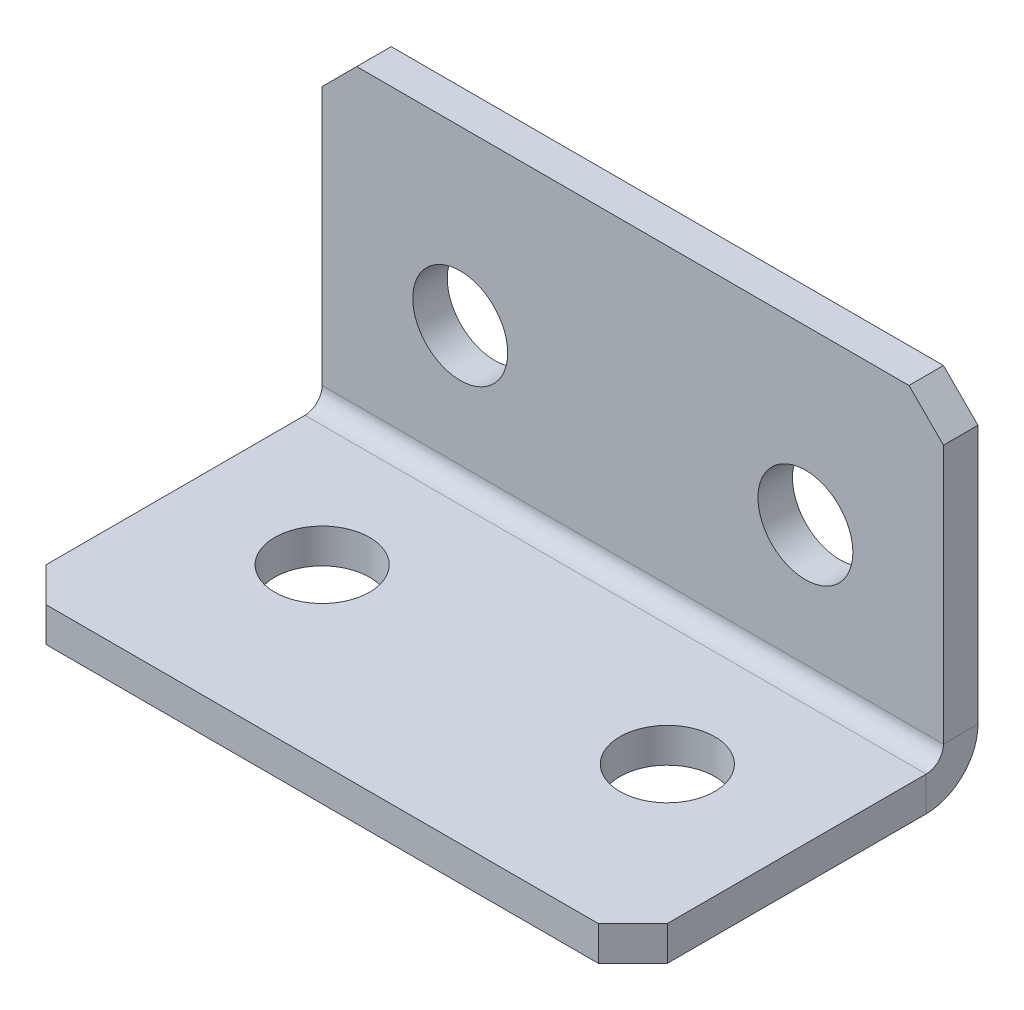
ISO-10303-21;
HEADER;
FILE_DESCRIPTION(('STEP AP214'),'2;1');
FILE_NAME('part.step','',(''),(''),'','','');
FILE_SCHEMA(('AUTOMOTIVE_DESIGN { 1 0 10303 214 1 1 1 1 }'));
ENDSEC;
DATA;
#1=APPLICATION_CONTEXT('core data for automotive mechanical design processes');
#2=APPLICATION_PROTOCOL_DEFINITION('international standard','automotive_design',2000,#1);
#3=PRODUCT_CONTEXT('',#1,'mechanical');
#4=PRODUCT('Part','Part','',(#3));
#5=PRODUCT_RELATED_PRODUCT_CATEGORY('part','',(#4));
#6=PRODUCT_DEFINITION_FORMATION('','',#4);
#7=PRODUCT_DEFINITION_CONTEXT('part definition',#1,'design');
#8=PRODUCT_DEFINITION('design','',#6,#7);
#9=PRODUCT_DEFINITION_SHAPE('','',#8);
#10=(LENGTH_UNIT() NAMED_UNIT(*) SI_UNIT(.MILLI.,.METRE.));
#11=(NAMED_UNIT(*) PLANE_ANGLE_UNIT() SI_UNIT($,.RADIAN.));
#12=(NAMED_UNIT(*) SI_UNIT($,.STERADIAN.) SOLID_ANGLE_UNIT());
#13=UNCERTAINTY_MEASURE_WITH_UNIT(LENGTH_MEASURE(1.E-05),#10,'distance_accuracy_value','');
#14=(GEOMETRIC_REPRESENTATION_CONTEXT(3) GLOBAL_UNCERTAINTY_ASSIGNED_CONTEXT((#13)) GLOBAL_UNIT_ASSIGNED_CONTEXT((#10,
#11,#12)) REPRESENTATION_CONTEXT('',''));
#15=CARTESIAN_POINT('',(0.,0.,0.));
#16=DIRECTION('',(0.,0.,1.));
#17=DIRECTION('',(1.,0.,0.));
#18=AXIS2_PLACEMENT_3D('',#15,#16,#17);
#19=CARTESIAN_POINT('',(18.,0.,2.));
#20=DIRECTION('',(-1.,0.,0.));
#21=DIRECTION('',(0.,1.,0.));
#22=AXIS2_PLACEMENT_3D('',#19,#20,#21);
#23=PLANE('',#22);
#24=DIRECTION('',(0.,1.,0.));
#25=VECTOR('',#24,1.);
#26=CARTESIAN_POINT('',(18.,0.,0.));
#27=LINE('',#26,#25);
#28=CARTESIAN_POINT('',(18.,3.,0.));
#29=VERTEX_POINT('',#28);
#30=CARTESIAN_POINT('',(18.,18.,0.));
#31=VERTEX_POINT('',#30);
#32=EDGE_CURVE('E266',#29,#31,#27,.T.);
#33=ORIENTED_EDGE('',*,*,#32,.T.);
#34=DIRECTION('',(0.,0.,-1.));
#35=VECTOR('',#34,1.);
#36=CARTESIAN_POINT('',(18.,18.,2.));
#37=LINE('',#36,#35);
#38=CARTESIAN_POINT('',(18.,18.,2.));
#39=VERTEX_POINT('',#38);
#40=EDGE_CURVE('E296',#31,#39,#37,.F.);
#41=ORIENTED_EDGE('',*,*,#40,.T.);
#42=DIRECTION('',(0.,1.,0.));
#43=VECTOR('',#42,1.);
#44=CARTESIAN_POINT('',(18.,0.,2.));
#45=LINE('',#44,#43);
#46=CARTESIAN_POINT('',(18.,3.,2.));
#47=VERTEX_POINT('',#46);
#48=EDGE_CURVE('E254',#47,#39,#45,.T.);
#49=ORIENTED_EDGE('',*,*,#48,.F.);
#50=DIRECTION('',(0.,0.,-1.));
#51=VECTOR('',#50,1.);
#52=CARTESIAN_POINT('',(18.,3.,2.));
#53=LINE('',#52,#51);
#54=EDGE_CURVE('E233',#47,#29,#53,.T.);
#55=ORIENTED_EDGE('',*,*,#54,.T.);
#56=EDGE_LOOP('',(#33,#41,#49,#55));
#57=FACE_BOUND('',#56,.T.);
#58=ADVANCED_FACE('F70',(#57),#23,.F.);
#59=CARTESIAN_POINT('',(0.,0.,2.));
#60=DIRECTION('',(0.,0.,-1.));
#61=DIRECTION('',(-1.,0.,0.));
#62=AXIS2_PLACEMENT_3D('',#59,#60,#61);
#63=PLANE('',#62);
#64=CARTESIAN_POINT('',(-10.,10.,2.));
#65=DIRECTION('',(0.,0.,1.));
#66=DIRECTION('',(1.,0.,0.));
#67=AXIS2_PLACEMENT_3D('',#64,#65,#66);
#68=CIRCLE('',#67,2.75);
#69=CARTESIAN_POINT('',(-7.25,10.,2.));
#70=VERTEX_POINT('',#69);
#71=EDGE_CURVE('E675',#70,#70,#68,.T.);
#72=ORIENTED_EDGE('',*,*,#71,.F.);
#73=EDGE_LOOP('',(#72));
#74=FACE_BOUND('',#73,.T.);
#75=CARTESIAN_POINT('',(10.,10.,2.));
#76=DIRECTION('',(0.,0.,1.));
#77=DIRECTION('',(1.,0.,0.));
#78=AXIS2_PLACEMENT_3D('',#75,#76,#77);
#79=CIRCLE('',#78,2.75);
#80=CARTESIAN_POINT('',(12.75,10.,2.));
#81=VERTEX_POINT('',#80);
#82=EDGE_CURVE('E666',#81,#81,#79,.T.);
#83=ORIENTED_EDGE('',*,*,#82,.F.);
#84=EDGE_LOOP('',(#83));
#85=FACE_BOUND('',#84,.T.);
#86=ORIENTED_EDGE('',*,*,#48,.T.);
#87=DIRECTION('',(0.707106781186549,-0.707106781186546,0.));
#88=VECTOR('',#87,1.);
#89=CARTESIAN_POINT('',(18.,18.,2.));
#90=LINE('',#89,#88);
#91=CARTESIAN_POINT('',(16.,20.,2.));
#92=VERTEX_POINT('',#91);
#93=EDGE_CURVE('E303',#39,#92,#90,.F.);
#94=ORIENTED_EDGE('',*,*,#93,.T.);
#95=DIRECTION('',(-1.,0.,0.));
#96=VECTOR('',#95,1.);
#97=CARTESIAN_POINT('',(-18.,20.,2.));
#98=LINE('',#97,#96);
#99=CARTESIAN_POINT('',(-16.,20.,2.));
#100=VERTEX_POINT('',#99);
#101=EDGE_CURVE('E259',#92,#100,#98,.T.);
#102=ORIENTED_EDGE('',*,*,#101,.T.);
#103=DIRECTION('',(0.707106781186546,0.707106781186549,0.));
#104=VECTOR('',#103,1.);
#105=CARTESIAN_POINT('',(-16.,20.,2.));
#106=LINE('',#105,#104);
#107=CARTESIAN_POINT('',(-18.,18.,2.));
#108=VERTEX_POINT('',#107);
#109=EDGE_CURVE('E300',#100,#108,#106,.F.);
#110=ORIENTED_EDGE('',*,*,#109,.T.);
#111=DIRECTION('',(0.,-1.,0.));
#112=VECTOR('',#111,1.);
#113=CARTESIAN_POINT('',(-18.,0.,2.));
#114=LINE('',#113,#112);
#115=CARTESIAN_POINT('',(-18.,3.,2.));
#116=VERTEX_POINT('',#115);
#117=EDGE_CURVE('E251',#108,#116,#114,.T.);
#118=ORIENTED_EDGE('',*,*,#117,.T.);
#119=DIRECTION('',(1.,0.,0.));
#120=VECTOR('',#119,1.);
#121=CARTESIAN_POINT('',(18.,3.,2.));
#122=LINE('',#121,#120);
#123=EDGE_CURVE('E238',#47,#116,#122,.F.);
#124=ORIENTED_EDGE('',*,*,#123,.F.);
#125=EDGE_LOOP('',(#86,#94,#102,#110,#118,#124));
#126=FACE_BOUND('',#125,.T.);
#127=ADVANCED_FACE('F328',(#74,#85,#126),#63,.F.);
#128=CARTESIAN_POINT('',(0.,0.,0.));
#129=DIRECTION('',(0.,0.,-1.));
#130=DIRECTION('',(-1.,0.,0.));
#131=AXIS2_PLACEMENT_3D('',#128,#129,#130);
#132=PLANE('',#131);
#133=CARTESIAN_POINT('',(-10.,10.,0.));
#134=DIRECTION('',(0.,0.,-1.));
#135=DIRECTION('',(-1.,0.,0.));
#136=AXIS2_PLACEMENT_3D('',#133,#134,#135);
#137=CIRCLE('',#136,2.75);
#138=CARTESIAN_POINT('',(-12.75,10.,0.));
#139=VERTEX_POINT('',#138);
#140=EDGE_CURVE('E661',#139,#139,#137,.T.);
#141=ORIENTED_EDGE('',*,*,#140,.F.);
#142=EDGE_LOOP('',(#141));
#143=FACE_BOUND('',#142,.T.);
#144=CARTESIAN_POINT('',(10.,10.,0.));
#145=DIRECTION('',(0.,0.,-1.));
#146=DIRECTION('',(-1.,0.,0.));
#147=AXIS2_PLACEMENT_3D('',#144,#145,#146);
#148=CIRCLE('',#147,2.75);
#149=CARTESIAN_POINT('',(7.25,10.,0.));
#150=VERTEX_POINT('',#149);
#151=EDGE_CURVE('E228',#150,#150,#148,.T.);
#152=ORIENTED_EDGE('',*,*,#151,.F.);
#153=EDGE_LOOP('',(#152));
#154=FACE_BOUND('',#153,.T.);
#155=DIRECTION('',(-1.,0.,0.));
#156=VECTOR('',#155,1.);
#157=CARTESIAN_POINT('',(0.,20.,0.));
#158=LINE('',#157,#156);
#159=CARTESIAN_POINT('',(16.,20.,0.));
#160=VERTEX_POINT('',#159);
#161=CARTESIAN_POINT('',(-16.,20.,0.));
#162=VERTEX_POINT('',#161);
#163=EDGE_CURVE('E255',#160,#162,#158,.T.);
#164=ORIENTED_EDGE('',*,*,#163,.F.);
#165=DIRECTION('',(-0.707106781186549,0.707106781186546,0.));
#166=VECTOR('',#165,1.);
#167=CARTESIAN_POINT('',(18.,18.,0.));
#168=LINE('',#167,#166);
#169=EDGE_CURVE('E80',#160,#31,#168,.F.);
#170=ORIENTED_EDGE('',*,*,#169,.T.);
#171=ORIENTED_EDGE('',*,*,#32,.F.);
#172=DIRECTION('',(1.,0.,0.));
#173=VECTOR('',#172,1.);
#174=CARTESIAN_POINT('',(18.,3.,0.));
#175=LINE('',#174,#173);
#176=CARTESIAN_POINT('',(-18.,3.00000000000001,0.));
#177=VERTEX_POINT('',#176);
#178=EDGE_CURVE('E169',#29,#177,#175,.F.);
#179=ORIENTED_EDGE('',*,*,#178,.T.);
#180=DIRECTION('',(0.,1.,0.));
#181=VECTOR('',#180,1.);
#182=CARTESIAN_POINT('',(-18.,0.,0.));
#183=LINE('',#182,#181);
#184=CARTESIAN_POINT('',(-18.,18.,0.));
#185=VERTEX_POINT('',#184);
#186=EDGE_CURVE('E248',#185,#177,#183,.F.);
#187=ORIENTED_EDGE('',*,*,#186,.F.);
#188=DIRECTION('',(-0.707106781186546,-0.707106781186549,0.));
#189=VECTOR('',#188,1.);
#190=CARTESIAN_POINT('',(-18.,18.,0.));
#191=LINE('',#190,#189);
#192=EDGE_CURVE('E92',#185,#162,#191,.F.);
#193=ORIENTED_EDGE('',*,*,#192,.T.);
#194=EDGE_LOOP('',(#164,#170,#171,#179,#187,#193));
#195=FACE_BOUND('',#194,.T.);
#196=ADVANCED_FACE('F319',(#143,#154,#195),#132,.T.);
#197=CARTESIAN_POINT('',(-18.,20.,2.));
#198=DIRECTION('',(0.,-1.,0.));
#199=DIRECTION('',(-1.,0.,0.));
#200=AXIS2_PLACEMENT_3D('',#197,#198,#199);
#201=PLANE('',#200);
#202=ORIENTED_EDGE('',*,*,#101,.F.);
#203=DIRECTION('',(0.,0.,1.));
#204=VECTOR('',#203,1.);
#205=CARTESIAN_POINT('',(16.,20.,2.));
#206=LINE('',#205,#204);
#207=EDGE_CURVE('E310',#92,#160,#206,.F.);
#208=ORIENTED_EDGE('',*,*,#207,.T.);
#209=ORIENTED_EDGE('',*,*,#163,.T.);
#210=DIRECTION('',(0.,0.,-1.));
#211=VECTOR('',#210,1.);
#212=CARTESIAN_POINT('',(-16.,20.,2.));
#213=LINE('',#212,#211);
#214=EDGE_CURVE('E306',#162,#100,#213,.F.);
#215=ORIENTED_EDGE('',*,*,#214,.T.);
#216=EDGE_LOOP('',(#202,#208,#209,#215));
#217=FACE_BOUND('',#216,.T.);
#218=ADVANCED_FACE('F331',(#217),#201,.F.);
#219=CARTESIAN_POINT('',(-18.,0.,2.));
#220=DIRECTION('',(1.,0.,0.));
#221=DIRECTION('',(0.,-1.,0.));
#222=AXIS2_PLACEMENT_3D('',#219,#220,#221);
#223=PLANE('',#222);
#224=ORIENTED_EDGE('',*,*,#117,.F.);
#225=DIRECTION('',(0.,0.,1.));
#226=VECTOR('',#225,1.);
#227=CARTESIAN_POINT('',(-18.,18.,2.));
#228=LINE('',#227,#226);
#229=EDGE_CURVE('E13',#108,#185,#228,.F.);
#230=ORIENTED_EDGE('',*,*,#229,.T.);
#231=ORIENTED_EDGE('',*,*,#186,.T.);
#232=DIRECTION('',(0.,0.,-1.));
#233=VECTOR('',#232,1.);
#234=CARTESIAN_POINT('',(-18.,3.,2.));
#235=LINE('',#234,#233);
#236=EDGE_CURVE('E244',#116,#177,#235,.T.);
#237=ORIENTED_EDGE('',*,*,#236,.F.);
#238=EDGE_LOOP('',(#224,#230,#231,#237));
#239=FACE_BOUND('',#238,.T.);
#240=ADVANCED_FACE('F335',(#239),#223,.F.);
#241=CARTESIAN_POINT('',(-18.,3.,3.));
#242=DIRECTION('',(-1.,0.,0.));
#243=DIRECTION('',(0.,0.,1.));
#244=AXIS2_PLACEMENT_3D('',#241,#242,#243);
#245=PLANE('',#244);
#246=DIRECTION('',(0.,1.,0.));
#247=VECTOR('',#246,1.);
#248=CARTESIAN_POINT('',(-18.,0.,2.99999999999999));
#249=LINE('',#248,#247);
#250=CARTESIAN_POINT('',(-18.,2.,3.));
#251=VERTEX_POINT('',#250);
#252=CARTESIAN_POINT('',(-18.,0.,2.99999999999999));
#253=VERTEX_POINT('',#252);
#254=EDGE_CURVE('E224',#251,#253,#249,.F.);
#255=ORIENTED_EDGE('',*,*,#254,.F.);
#256=CARTESIAN_POINT('',(-18.,3.,3.));
#257=DIRECTION('',(1.,0.,0.));
#258=DIRECTION('',(0.,0.,-1.));
#259=AXIS2_PLACEMENT_3D('',#256,#257,#258);
#260=CIRCLE('',#259,1.);
#261=EDGE_CURVE('E173',#116,#251,#260,.F.);
#262=ORIENTED_EDGE('',*,*,#261,.F.);
#263=ORIENTED_EDGE('',*,*,#236,.T.);
#264=CARTESIAN_POINT('',(-18.,3.,3.));
#265=DIRECTION('',(1.,0.,0.));
#266=DIRECTION('',(0.,0.,-1.));
#267=AXIS2_PLACEMENT_3D('',#264,#265,#266);
#268=CIRCLE('',#267,3.);
#269=EDGE_CURVE('E231',#177,#253,#268,.F.);
#270=ORIENTED_EDGE('',*,*,#269,.T.);
#271=EDGE_LOOP('',(#255,#262,#263,#270));
#272=FACE_BOUND('',#271,.T.);
#273=ADVANCED_FACE('F339',(#272),#245,.T.);
#274=CARTESIAN_POINT('',(18.,3.,3.));
#275=DIRECTION('',(-1.,0.,0.));
#276=DIRECTION('',(0.,0.,1.));
#277=AXIS2_PLACEMENT_3D('',#274,#275,#276);
#278=PLANE('',#277);
#279=CARTESIAN_POINT('',(18.,3.,3.));
#280=DIRECTION('',(1.,0.,0.));
#281=DIRECTION('',(0.,0.,-1.));
#282=AXIS2_PLACEMENT_3D('',#279,#280,#281);
#283=CIRCLE('',#282,1.);
#284=CARTESIAN_POINT('',(18.,2.,3.));
#285=VERTEX_POINT('',#284);
#286=EDGE_CURVE('E180',#285,#47,#283,.T.);
#287=ORIENTED_EDGE('',*,*,#286,.F.);
#288=DIRECTION('',(0.,1.,0.));
#289=VECTOR('',#288,1.);
#290=CARTESIAN_POINT('',(18.,2.,3.));
#291=LINE('',#290,#289);
#292=CARTESIAN_POINT('',(18.,0.,2.99999999999999));
#293=VERTEX_POINT('',#292);
#294=EDGE_CURVE('E177',#285,#293,#291,.F.);
#295=ORIENTED_EDGE('',*,*,#294,.T.);
#296=CARTESIAN_POINT('',(18.,3.,3.));
#297=DIRECTION('',(1.,0.,0.));
#298=DIRECTION('',(0.,0.,-1.));
#299=AXIS2_PLACEMENT_3D('',#296,#297,#298);
#300=CIRCLE('',#299,3.);
#301=EDGE_CURVE('E161',#293,#29,#300,.T.);
#302=ORIENTED_EDGE('',*,*,#301,.T.);
#303=ORIENTED_EDGE('',*,*,#54,.F.);
#304=EDGE_LOOP('',(#287,#295,#302,#303));
#305=FACE_BOUND('',#304,.T.);
#306=ADVANCED_FACE('F178',(#305),#278,.F.);
#307=CARTESIAN_POINT('',(18.,3.,3.));
#308=DIRECTION('',(1.,0.,0.));
#309=DIRECTION('',(0.,-1.,0.));
#310=AXIS2_PLACEMENT_3D('',#307,#308,#309);
#311=CYLINDRICAL_SURFACE('',#310,3.);
#312=ORIENTED_EDGE('',*,*,#178,.F.);
#313=ORIENTED_EDGE('',*,*,#301,.F.);
#314=DIRECTION('',(1.,0.,0.));
#315=VECTOR('',#314,1.);
#316=CARTESIAN_POINT('',(-18.,0.,2.99999999999999));
#317=LINE('',#316,#315);
#318=EDGE_CURVE('E166',#293,#253,#317,.F.);
#319=ORIENTED_EDGE('',*,*,#318,.T.);
#320=ORIENTED_EDGE('',*,*,#269,.F.);
#321=EDGE_LOOP('',(#312,#313,#319,#320));
#322=FACE_BOUND('',#321,.T.);
#323=ADVANCED_FACE('F163',(#322),#311,.T.);
#324=CARTESIAN_POINT('',(18.,3.,3.));
#325=DIRECTION('',(1.,0.,0.));
#326=DIRECTION('',(0.,-1.,0.));
#327=AXIS2_PLACEMENT_3D('',#324,#325,#326);
#328=CYLINDRICAL_SURFACE('',#327,1.);
#329=ORIENTED_EDGE('',*,*,#123,.T.);
#330=ORIENTED_EDGE('',*,*,#261,.T.);
#331=DIRECTION('',(1.,0.,0.));
#332=VECTOR('',#331,1.);
#333=CARTESIAN_POINT('',(-18.,2.,3.));
#334=LINE('',#333,#332);
#335=EDGE_CURVE('E186',#251,#285,#334,.T.);
#336=ORIENTED_EDGE('',*,*,#335,.T.);
#337=ORIENTED_EDGE('',*,*,#286,.T.);
#338=EDGE_LOOP('',(#329,#330,#336,#337));
#339=FACE_BOUND('',#338,.T.);
#340=ADVANCED_FACE('F342',(#339),#328,.F.);
#341=CARTESIAN_POINT('',(-18.,0.,1.99999999999999));
#342=DIRECTION('',(1.,0.,0.));
#343=DIRECTION('',(0.,0.,-1.));
#344=AXIS2_PLACEMENT_3D('',#341,#342,#343);
#345=PLANE('',#344);
#346=DIRECTION('',(0.,0.,-1.));
#347=VECTOR('',#346,1.);
#348=CARTESIAN_POINT('',(-18.,0.,0.));
#349=LINE('',#348,#347);
#350=CARTESIAN_POINT('',(-18.,0.,18.));
#351=VERTEX_POINT('',#350);
#352=EDGE_CURVE('E194',#351,#253,#349,.T.);
#353=ORIENTED_EDGE('',*,*,#352,.F.);
#354=DIRECTION('',(0.,1.,0.));
#355=VECTOR('',#354,1.);
#356=CARTESIAN_POINT('',(-18.,0.,18.));
#357=LINE('',#356,#355);
#358=CARTESIAN_POINT('',(-18.,1.99999999999994,18.));
#359=VERTEX_POINT('',#358);
#360=EDGE_CURVE('E292',#351,#359,#357,.T.);
#361=ORIENTED_EDGE('',*,*,#360,.T.);
#362=DIRECTION('',(0.,0.,1.));
#363=VECTOR('',#362,1.);
#364=CARTESIAN_POINT('',(-18.,2.,2.));
#365=LINE('',#364,#363);
#366=EDGE_CURVE('E196',#359,#251,#365,.F.);
#367=ORIENTED_EDGE('',*,*,#366,.T.);
#368=ORIENTED_EDGE('',*,*,#254,.T.);
#369=EDGE_LOOP('',(#353,#361,#367,#368));
#370=FACE_BOUND('',#369,.T.);
#371=ADVANCED_FACE('F359',(#370),#345,.F.);
#372=CARTESIAN_POINT('',(18.,0.,20.));
#373=DIRECTION('',(-1.,0.,0.));
#374=DIRECTION('',(0.,0.,1.));
#375=AXIS2_PLACEMENT_3D('',#372,#373,#374);
#376=PLANE('',#375);
#377=DIRECTION('',(0.,0.,-1.));
#378=VECTOR('',#377,1.);
#379=CARTESIAN_POINT('',(18.,1.99999999999994,20.));
#380=LINE('',#379,#378);
#381=CARTESIAN_POINT('',(18.,1.99999999999994,18.));
#382=VERTEX_POINT('',#381);
#383=EDGE_CURVE('E217',#285,#382,#380,.F.);
#384=ORIENTED_EDGE('',*,*,#383,.T.);
#385=DIRECTION('',(0.,-1.,0.));
#386=VECTOR('',#385,1.);
#387=CARTESIAN_POINT('',(18.,0.,18.));
#388=LINE('',#387,#386);
#389=CARTESIAN_POINT('',(18.,0.,18.));
#390=VERTEX_POINT('',#389);
#391=EDGE_CURVE('E200',#382,#390,#388,.T.);
#392=ORIENTED_EDGE('',*,*,#391,.T.);
#393=DIRECTION('',(0.,0.,1.));
#394=VECTOR('',#393,1.);
#395=CARTESIAN_POINT('',(18.,0.,0.));
#396=LINE('',#395,#394);
#397=EDGE_CURVE('E191',#293,#390,#396,.T.);
#398=ORIENTED_EDGE('',*,*,#397,.F.);
#399=ORIENTED_EDGE('',*,*,#294,.F.);
#400=EDGE_LOOP('',(#384,#392,#398,#399));
#401=FACE_BOUND('',#400,.T.);
#402=ADVANCED_FACE('F198',(#401),#376,.F.);
#403=CARTESIAN_POINT('',(0.,0.,0.));
#404=DIRECTION('',(0.,1.,0.));
#405=DIRECTION('',(0.,0.,1.));
#406=AXIS2_PLACEMENT_3D('',#403,#404,#405);
#407=PLANE('',#406);
#408=CARTESIAN_POINT('',(-10.,0.,10.));
#409=DIRECTION('',(0.,1.,0.));
#410=DIRECTION('',(0.,0.,1.));
#411=AXIS2_PLACEMENT_3D('',#408,#409,#410);
#412=CIRCLE('',#411,2.74999999999999);
#413=CARTESIAN_POINT('',(-10.,0.,12.75));
#414=VERTEX_POINT('',#413);
#415=EDGE_CURVE('E687',#414,#414,#412,.T.);
#416=ORIENTED_EDGE('',*,*,#415,.T.);
#417=EDGE_LOOP('',(#416));
#418=FACE_BOUND('',#417,.T.);
#419=CARTESIAN_POINT('',(10.,0.,10.));
#420=DIRECTION('',(0.,1.,0.));
#421=DIRECTION('',(0.,0.,1.));
#422=AXIS2_PLACEMENT_3D('',#419,#420,#421);
#423=CIRCLE('',#422,2.74999999999999);
#424=CARTESIAN_POINT('',(10.,0.,12.75));
#425=VERTEX_POINT('',#424);
#426=EDGE_CURVE('E679',#425,#425,#423,.T.);
#427=ORIENTED_EDGE('',*,*,#426,.T.);
#428=EDGE_LOOP('',(#427));
#429=FACE_BOUND('',#428,.T.);
#430=ORIENTED_EDGE('',*,*,#397,.T.);
#431=DIRECTION('',(0.707106781186546,0.,-0.707106781186549));
#432=VECTOR('',#431,1.);
#433=CARTESIAN_POINT('',(16.,0.,20.));
#434=LINE('',#433,#432);
#435=CARTESIAN_POINT('',(16.,0.,20.));
#436=VERTEX_POINT('',#435);
#437=EDGE_CURVE('E289',#390,#436,#434,.F.);
#438=ORIENTED_EDGE('',*,*,#437,.T.);
#439=DIRECTION('',(-1.,0.,0.));
#440=VECTOR('',#439,1.);
#441=CARTESIAN_POINT('',(0.,0.,20.));
#442=LINE('',#441,#440);
#443=CARTESIAN_POINT('',(-16.,0.,20.));
#444=VERTEX_POINT('',#443);
#445=EDGE_CURVE('E202',#436,#444,#442,.T.);
#446=ORIENTED_EDGE('',*,*,#445,.T.);
#447=DIRECTION('',(0.707106781186549,0.,0.707106781186546));
#448=VECTOR('',#447,1.);
#449=CARTESIAN_POINT('',(-18.,0.,18.));
#450=LINE('',#449,#448);
#451=EDGE_CURVE('E286',#444,#351,#450,.F.);
#452=ORIENTED_EDGE('',*,*,#451,.T.);
#453=ORIENTED_EDGE('',*,*,#352,.T.);
#454=ORIENTED_EDGE('',*,*,#318,.F.);
#455=EDGE_LOOP('',(#430,#438,#446,#452,#453,#454));
#456=FACE_BOUND('',#455,.T.);
#457=ADVANCED_FACE('F190',(#418,#429,#456),#407,.F.);
#458=CARTESIAN_POINT('',(0.,2.00000000000001,0.));
#459=DIRECTION('',(0.,1.,0.));
#460=DIRECTION('',(0.,0.,1.));
#461=AXIS2_PLACEMENT_3D('',#458,#459,#460);
#462=PLANE('',#461);
#463=CARTESIAN_POINT('',(-10.,1.99999999999997,10.));
#464=DIRECTION('',(0.,1.,0.));
#465=DIRECTION('',(0.,0.,1.));
#466=AXIS2_PLACEMENT_3D('',#463,#464,#465);
#467=CIRCLE('',#466,2.74999999999999);
#468=CARTESIAN_POINT('',(-10.,1.99999999999996,12.75));
#469=VERTEX_POINT('',#468);
#470=EDGE_CURVE('E691',#469,#469,#467,.T.);
#471=ORIENTED_EDGE('',*,*,#470,.F.);
#472=EDGE_LOOP('',(#471));
#473=FACE_BOUND('',#472,.T.);
#474=CARTESIAN_POINT('',(10.,1.99999999999997,10.));
#475=DIRECTION('',(0.,1.,0.));
#476=DIRECTION('',(0.,0.,1.));
#477=AXIS2_PLACEMENT_3D('',#474,#475,#476);
#478=CIRCLE('',#477,2.74999999999999);
#479=CARTESIAN_POINT('',(10.,1.99999999999996,12.75));
#480=VERTEX_POINT('',#479);
#481=EDGE_CURVE('E683',#480,#480,#478,.T.);
#482=ORIENTED_EDGE('',*,*,#481,.F.);
#483=EDGE_LOOP('',(#482));
#484=FACE_BOUND('',#483,.T.);
#485=DIRECTION('',(1.,0.,0.));
#486=VECTOR('',#485,1.);
#487=CARTESIAN_POINT('',(-18.,1.99999999999994,20.));
#488=LINE('',#487,#486);
#489=CARTESIAN_POINT('',(16.,1.99999999999994,20.));
#490=VERTEX_POINT('',#489);
#491=CARTESIAN_POINT('',(-16.,1.99999999999994,20.));
#492=VERTEX_POINT('',#491);
#493=EDGE_CURVE('E210',#490,#492,#488,.F.);
#494=ORIENTED_EDGE('',*,*,#493,.F.);
#495=DIRECTION('',(-0.707106781186546,0.,0.707106781186549));
#496=VECTOR('',#495,1.);
#497=CARTESIAN_POINT('',(18.,1.99999999999994,18.));
#498=LINE('',#497,#496);
#499=EDGE_CURVE('E281',#490,#382,#498,.F.);
#500=ORIENTED_EDGE('',*,*,#499,.T.);
#501=ORIENTED_EDGE('',*,*,#383,.F.);
#502=ORIENTED_EDGE('',*,*,#335,.F.);
#503=ORIENTED_EDGE('',*,*,#366,.F.);
#504=DIRECTION('',(-0.707106781186549,0.,-0.707106781186546));
#505=VECTOR('',#504,1.);
#506=CARTESIAN_POINT('',(-18.,1.99999999999994,18.));
#507=LINE('',#506,#505);
#508=EDGE_CURVE('E278',#359,#492,#507,.F.);
#509=ORIENTED_EDGE('',*,*,#508,.T.);
#510=EDGE_LOOP('',(#494,#500,#501,#502,#503,#509));
#511=FACE_BOUND('',#510,.T.);
#512=ADVANCED_FACE('F346',(#473,#484,#511),#462,.T.);
#513=CARTESIAN_POINT('',(-18.,0.,20.));
#514=DIRECTION('',(0.,0.,-1.));
#515=DIRECTION('',(0.,1.,0.));
#516=AXIS2_PLACEMENT_3D('',#513,#514,#515);
#517=PLANE('',#516);
#518=ORIENTED_EDGE('',*,*,#445,.F.);
#519=DIRECTION('',(0.,1.,0.));
#520=VECTOR('',#519,1.);
#521=CARTESIAN_POINT('',(16.,0.,20.));
#522=LINE('',#521,#520);
#523=EDGE_CURVE('E274',#436,#490,#522,.T.);
#524=ORIENTED_EDGE('',*,*,#523,.T.);
#525=ORIENTED_EDGE('',*,*,#493,.T.);
#526=DIRECTION('',(0.,-1.,0.));
#527=VECTOR('',#526,1.);
#528=CARTESIAN_POINT('',(-16.,0.,20.));
#529=LINE('',#528,#527);
#530=EDGE_CURVE('E263',#492,#444,#529,.T.);
#531=ORIENTED_EDGE('',*,*,#530,.T.);
#532=EDGE_LOOP('',(#518,#524,#525,#531));
#533=FACE_BOUND('',#532,.T.);
#534=ADVANCED_FACE('F353',(#533),#517,.F.);
#535=CARTESIAN_POINT('',(10.,10.,2.));
#536=DIRECTION('',(0.,0.,1.));
#537=DIRECTION('',(1.,0.,0.));
#538=AXIS2_PLACEMENT_3D('',#535,#536,#537);
#539=CYLINDRICAL_SURFACE('',#538,2.75);
#540=ORIENTED_EDGE('',*,*,#82,.T.);
#541=EDGE_LOOP('',(#540));
#542=FACE_BOUND('',#541,.T.);
#543=ORIENTED_EDGE('',*,*,#151,.T.);
#544=EDGE_LOOP('',(#543));
#545=FACE_BOUND('',#544,.T.);
#546=ADVANCED_FACE('F437',(#542,#545),#539,.F.);
#547=CARTESIAN_POINT('',(-10.,10.,2.));
#548=DIRECTION('',(0.,0.,1.));
#549=DIRECTION('',(1.,0.,0.));
#550=AXIS2_PLACEMENT_3D('',#547,#548,#549);
#551=CYLINDRICAL_SURFACE('',#550,2.75);
#552=ORIENTED_EDGE('',*,*,#71,.T.);
#553=EDGE_LOOP('',(#552));
#554=FACE_BOUND('',#553,.T.);
#555=ORIENTED_EDGE('',*,*,#140,.T.);
#556=EDGE_LOOP('',(#555));
#557=FACE_BOUND('',#556,.T.);
#558=ADVANCED_FACE('F428',(#554,#557),#551,.F.);
#559=CARTESIAN_POINT('',(10.,1.99999999999997,10.));
#560=DIRECTION('',(0.,1.,0.));
#561=DIRECTION('',(0.,0.,1.));
#562=AXIS2_PLACEMENT_3D('',#559,#560,#561);
#563=CYLINDRICAL_SURFACE('',#562,2.74999999999999);
#564=ORIENTED_EDGE('',*,*,#426,.F.);
#565=EDGE_LOOP('',(#564));
#566=FACE_BOUND('',#565,.T.);
#567=ORIENTED_EDGE('',*,*,#481,.T.);
#568=EDGE_LOOP('',(#567));
#569=FACE_BOUND('',#568,.T.);
#570=ADVANCED_FACE('F419',(#566,#569),#563,.F.);
#571=CARTESIAN_POINT('',(-10.,1.99999999999997,10.));
#572=DIRECTION('',(0.,1.,0.));
#573=DIRECTION('',(0.,0.,1.));
#574=AXIS2_PLACEMENT_3D('',#571,#572,#573);
#575=CYLINDRICAL_SURFACE('',#574,2.74999999999999);
#576=ORIENTED_EDGE('',*,*,#415,.F.);
#577=EDGE_LOOP('',(#576));
#578=FACE_BOUND('',#577,.T.);
#579=ORIENTED_EDGE('',*,*,#470,.T.);
#580=EDGE_LOOP('',(#579));
#581=FACE_BOUND('',#580,.T.);
#582=ADVANCED_FACE('F385',(#578,#581),#575,.F.);
#583=CARTESIAN_POINT('',(16.,0.,20.));
#584=DIRECTION('',(-0.707106781186549,0.,-0.707106781186546));
#585=DIRECTION('',(0.,1.,0.));
#586=AXIS2_PLACEMENT_3D('',#583,#584,#585);
#587=PLANE('',#586);
#588=ORIENTED_EDGE('',*,*,#437,.F.);
#589=ORIENTED_EDGE('',*,*,#391,.F.);
#590=ORIENTED_EDGE('',*,*,#499,.F.);
#591=ORIENTED_EDGE('',*,*,#523,.F.);
#592=EDGE_LOOP('',(#588,#589,#590,#591));
#593=FACE_BOUND('',#592,.T.);
#594=ADVANCED_FACE('F348',(#593),#587,.F.);
#595=CARTESIAN_POINT('',(-18.,0.,18.));
#596=DIRECTION('',(0.707106781186546,0.,-0.707106781186549));
#597=DIRECTION('',(0.,1.,0.));
#598=AXIS2_PLACEMENT_3D('',#595,#596,#597);
#599=PLANE('',#598);
#600=ORIENTED_EDGE('',*,*,#451,.F.);
#601=ORIENTED_EDGE('',*,*,#530,.F.);
#602=ORIENTED_EDGE('',*,*,#508,.F.);
#603=ORIENTED_EDGE('',*,*,#360,.F.);
#604=EDGE_LOOP('',(#600,#601,#602,#603));
#605=FACE_BOUND('',#604,.T.);
#606=ADVANCED_FACE('F356',(#605),#599,.F.);
#607=CARTESIAN_POINT('',(18.,18.,2.));
#608=DIRECTION('',(-0.707106781186546,-0.707106781186549,0.));
#609=DIRECTION('',(0.,0.,1.));
#610=AXIS2_PLACEMENT_3D('',#607,#608,#609);
#611=PLANE('',#610);
#612=ORIENTED_EDGE('',*,*,#169,.F.);
#613=ORIENTED_EDGE('',*,*,#207,.F.);
#614=ORIENTED_EDGE('',*,*,#93,.F.);
#615=ORIENTED_EDGE('',*,*,#40,.F.);
#616=EDGE_LOOP('',(#612,#613,#614,#615));
#617=FACE_BOUND('',#616,.T.);
#618=ADVANCED_FACE('F325',(#617),#611,.F.);
#619=CARTESIAN_POINT('',(-16.,20.,2.));
#620=DIRECTION('',(0.707106781186549,-0.707106781186546,0.));
#621=DIRECTION('',(0.,0.,1.));
#622=AXIS2_PLACEMENT_3D('',#619,#620,#621);
#623=PLANE('',#622);
#624=ORIENTED_EDGE('',*,*,#192,.F.);
#625=ORIENTED_EDGE('',*,*,#229,.F.);
#626=ORIENTED_EDGE('',*,*,#109,.F.);
#627=ORIENTED_EDGE('',*,*,#214,.F.);
#628=EDGE_LOOP('',(#624,#625,#626,#627));
#629=FACE_BOUND('',#628,.T.);
#630=ADVANCED_FACE('F73',(#629),#623,.F.);
#631=CLOSED_SHELL('',(#58,#127,#196,#218,#240,#273,#306,#323,#340,#371,#402,#457,#512,#534,#546,
#558,#570,#582,#594,#606,#618,#630));
#632=MANIFOLD_SOLID_BREP('B2',#631);
#633=ADVANCED_BREP_SHAPE_REPRESENTATION('',(#18,#632),#14);
#634=SHAPE_DEFINITION_REPRESENTATION(#9,#633);
ENDSEC;
END-ISO-10303-21;
